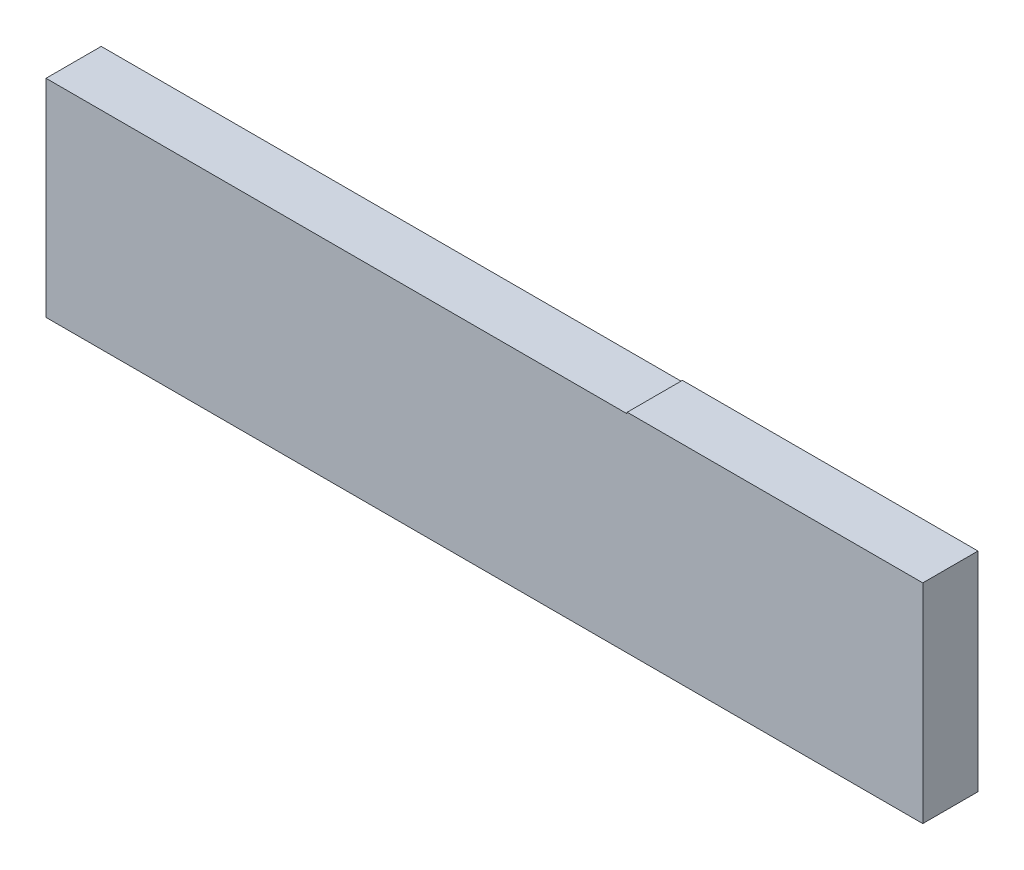
ISO-10303-21;
HEADER;
FILE_DESCRIPTION(('STEP AP214'),'2;1');
FILE_NAME('part.step','',(''),(''),'','','');
FILE_SCHEMA(('AUTOMOTIVE_DESIGN { 1 0 10303 214 1 1 1 1 }'));
ENDSEC;
DATA;
#1=APPLICATION_CONTEXT('core data for automotive mechanical design processes');
#2=APPLICATION_PROTOCOL_DEFINITION('international standard','automotive_design',2000,#1);
#3=PRODUCT_CONTEXT('',#1,'mechanical');
#4=PRODUCT('Part','Part','',(#3));
#5=PRODUCT_RELATED_PRODUCT_CATEGORY('part','',(#4));
#6=PRODUCT_DEFINITION_FORMATION('','',#4);
#7=PRODUCT_DEFINITION_CONTEXT('part definition',#1,'design');
#8=PRODUCT_DEFINITION('design','',#6,#7);
#9=PRODUCT_DEFINITION_SHAPE('','',#8);
#10=(LENGTH_UNIT() NAMED_UNIT(*) SI_UNIT(.MILLI.,.METRE.));
#11=(NAMED_UNIT(*) PLANE_ANGLE_UNIT() SI_UNIT($,.RADIAN.));
#12=(NAMED_UNIT(*) SI_UNIT($,.STERADIAN.) SOLID_ANGLE_UNIT());
#13=UNCERTAINTY_MEASURE_WITH_UNIT(LENGTH_MEASURE(1.E-05),#10,'distance_accuracy_value','');
#14=(GEOMETRIC_REPRESENTATION_CONTEXT(3) GLOBAL_UNCERTAINTY_ASSIGNED_CONTEXT((#13)) GLOBAL_UNIT_ASSIGNED_CONTEXT((#10,
#11,#12)) REPRESENTATION_CONTEXT('',''));
#15=CARTESIAN_POINT('',(0.,0.,0.));
#16=DIRECTION('',(0.,0.,1.));
#17=DIRECTION('',(1.,0.,0.));
#18=AXIS2_PLACEMENT_3D('',#15,#16,#17);
#19=CARTESIAN_POINT('',(0.,0.,4.));
#20=DIRECTION('',(1.,0.,0.));
#21=DIRECTION('',(0.,0.,-1.));
#22=AXIS2_PLACEMENT_3D('',#19,#20,#21);
#23=PLANE('',#22);
#24=DIRECTION('',(0.,-1.,0.));
#25=VECTOR('',#24,1.);
#26=CARTESIAN_POINT('',(0.,0.,0.));
#27=LINE('',#26,#25);
#28=CARTESIAN_POINT('',(0.,15.,0.));
#29=VERTEX_POINT('',#28);
#30=CARTESIAN_POINT('',(0.,0.,0.));
#31=VERTEX_POINT('',#30);
#32=EDGE_CURVE('E117',#29,#31,#27,.T.);
#33=ORIENTED_EDGE('',*,*,#32,.T.);
#34=DIRECTION('',(0.,0.,-1.));
#35=VECTOR('',#34,1.);
#36=CARTESIAN_POINT('',(0.,0.,4.));
#37=LINE('',#36,#35);
#38=CARTESIAN_POINT('',(0.,0.,4.));
#39=VERTEX_POINT('',#38);
#40=EDGE_CURVE('E11',#39,#31,#37,.T.);
#41=ORIENTED_EDGE('',*,*,#40,.F.);
#42=DIRECTION('',(0.,-1.,0.));
#43=VECTOR('',#42,1.);
#44=CARTESIAN_POINT('',(0.,0.,4.));
#45=LINE('',#44,#43);
#46=CARTESIAN_POINT('',(0.,15.,4.));
#47=VERTEX_POINT('',#46);
#48=EDGE_CURVE('E127',#47,#39,#45,.T.);
#49=ORIENTED_EDGE('',*,*,#48,.F.);
#50=DIRECTION('',(0.,0.,-1.));
#51=VECTOR('',#50,1.);
#52=CARTESIAN_POINT('',(0.,15.,4.));
#53=LINE('',#52,#51);
#54=EDGE_CURVE('E113',#47,#29,#53,.T.);
#55=ORIENTED_EDGE('',*,*,#54,.T.);
#56=EDGE_LOOP('',(#33,#41,#49,#55));
#57=FACE_BOUND('',#56,.T.);
#58=ADVANCED_FACE('F33',(#57),#23,.F.);
#59=CARTESIAN_POINT('',(63.502314546912,0.,4.));
#60=DIRECTION('',(0.,1.,0.));
#61=DIRECTION('',(0.,0.,1.));
#62=AXIS2_PLACEMENT_3D('',#59,#60,#61);
#63=PLANE('',#62);
#64=DIRECTION('',(1.,0.,0.));
#65=VECTOR('',#64,1.);
#66=CARTESIAN_POINT('',(63.502314546912,0.,0.));
#67=LINE('',#66,#65);
#68=CARTESIAN_POINT('',(63.502314546912,0.,0.));
#69=VERTEX_POINT('',#68);
#70=EDGE_CURVE('E120',#31,#69,#67,.T.);
#71=ORIENTED_EDGE('',*,*,#70,.T.);
#72=DIRECTION('',(0.,0.,-1.));
#73=VECTOR('',#72,1.);
#74=CARTESIAN_POINT('',(63.502314546912,0.,4.));
#75=LINE('',#74,#73);
#76=CARTESIAN_POINT('',(63.502314546912,0.,4.));
#77=VERTEX_POINT('',#76);
#78=EDGE_CURVE('E41',#77,#69,#75,.T.);
#79=ORIENTED_EDGE('',*,*,#78,.F.);
#80=DIRECTION('',(1.,0.,0.));
#81=VECTOR('',#80,1.);
#82=CARTESIAN_POINT('',(0.,0.,4.));
#83=LINE('',#82,#81);
#84=EDGE_CURVE('E86',#39,#77,#83,.T.);
#85=ORIENTED_EDGE('',*,*,#84,.F.);
#86=ORIENTED_EDGE('',*,*,#40,.T.);
#87=EDGE_LOOP('',(#71,#79,#85,#86));
#88=FACE_BOUND('',#87,.T.);
#89=ADVANCED_FACE('F151',(#88),#63,.F.);
#90=CARTESIAN_POINT('',(63.502314546912,15.1,4.));
#91=DIRECTION('',(-1.,0.,0.));
#92=DIRECTION('',(0.,0.,1.));
#93=AXIS2_PLACEMENT_3D('',#90,#91,#92);
#94=PLANE('',#93);
#95=DIRECTION('',(0.,1.,0.));
#96=VECTOR('',#95,1.);
#97=CARTESIAN_POINT('',(63.502314546912,15.1,0.));
#98=LINE('',#97,#96);
#99=CARTESIAN_POINT('',(63.502314546912,15.1,0.));
#100=VERTEX_POINT('',#99);
#101=EDGE_CURVE('E122',#69,#100,#98,.T.);
#102=ORIENTED_EDGE('',*,*,#101,.T.);
#103=DIRECTION('',(0.,0.,-1.));
#104=VECTOR('',#103,1.);
#105=CARTESIAN_POINT('',(63.502314546912,15.1,4.));
#106=LINE('',#105,#104);
#107=CARTESIAN_POINT('',(63.502314546912,15.1,4.));
#108=VERTEX_POINT('',#107);
#109=EDGE_CURVE('E108',#108,#100,#106,.T.);
#110=ORIENTED_EDGE('',*,*,#109,.F.);
#111=DIRECTION('',(0.,1.,0.));
#112=VECTOR('',#111,1.);
#113=CARTESIAN_POINT('',(63.502314546912,15.1,4.));
#114=LINE('',#113,#112);
#115=EDGE_CURVE('E99',#77,#108,#114,.T.);
#116=ORIENTED_EDGE('',*,*,#115,.F.);
#117=ORIENTED_EDGE('',*,*,#78,.T.);
#118=EDGE_LOOP('',(#102,#110,#116,#117));
#119=FACE_BOUND('',#118,.T.);
#120=ADVANCED_FACE('F133',(#119),#94,.F.);
#121=CARTESIAN_POINT('',(42.0949347246998,15.1,4.));
#122=DIRECTION('',(0.,-1.,0.));
#123=DIRECTION('',(1.,0.,0.));
#124=AXIS2_PLACEMENT_3D('',#121,#122,#123);
#125=PLANE('',#124);
#126=DIRECTION('',(-1.,0.,0.));
#127=VECTOR('',#126,1.);
#128=CARTESIAN_POINT('',(42.0949347246998,15.1,0.));
#129=LINE('',#128,#127);
#130=CARTESIAN_POINT('',(42.0949347246998,15.1,0.));
#131=VERTEX_POINT('',#130);
#132=EDGE_CURVE('E107',#100,#131,#129,.T.);
#133=ORIENTED_EDGE('',*,*,#132,.T.);
#134=DIRECTION('',(0.,0.,-1.));
#135=VECTOR('',#134,1.);
#136=CARTESIAN_POINT('',(42.0949347246998,15.1,4.));
#137=LINE('',#136,#135);
#138=CARTESIAN_POINT('',(42.0949347246998,15.1,4.));
#139=VERTEX_POINT('',#138);
#140=EDGE_CURVE('E104',#139,#131,#137,.T.);
#141=ORIENTED_EDGE('',*,*,#140,.F.);
#142=DIRECTION('',(-1.,0.,0.));
#143=VECTOR('',#142,1.);
#144=CARTESIAN_POINT('',(42.0949347246998,15.1,4.));
#145=LINE('',#144,#143);
#146=EDGE_CURVE('E93',#108,#139,#145,.T.);
#147=ORIENTED_EDGE('',*,*,#146,.F.);
#148=ORIENTED_EDGE('',*,*,#109,.T.);
#149=EDGE_LOOP('',(#133,#141,#147,#148));
#150=FACE_BOUND('',#149,.T.);
#151=ADVANCED_FACE('F105',(#150),#125,.F.);
#152=CARTESIAN_POINT('',(42.0949347246998,15.,4.));
#153=DIRECTION('',(1.,0.,0.));
#154=DIRECTION('',(0.,0.,-1.));
#155=AXIS2_PLACEMENT_3D('',#152,#153,#154);
#156=PLANE('',#155);
#157=DIRECTION('',(0.,-1.,0.));
#158=VECTOR('',#157,1.);
#159=CARTESIAN_POINT('',(42.0949347246998,15.,0.));
#160=LINE('',#159,#158);
#161=CARTESIAN_POINT('',(42.0949347246998,15.,0.));
#162=VERTEX_POINT('',#161);
#163=EDGE_CURVE('E72',#131,#162,#160,.T.);
#164=ORIENTED_EDGE('',*,*,#163,.T.);
#165=DIRECTION('',(0.,0.,-1.));
#166=VECTOR('',#165,1.);
#167=CARTESIAN_POINT('',(42.0949347246998,15.,4.));
#168=LINE('',#167,#166);
#169=CARTESIAN_POINT('',(42.0949347246998,15.,4.));
#170=VERTEX_POINT('',#169);
#171=EDGE_CURVE('E109',#170,#162,#168,.T.);
#172=ORIENTED_EDGE('',*,*,#171,.F.);
#173=DIRECTION('',(0.,-1.,0.));
#174=VECTOR('',#173,1.);
#175=CARTESIAN_POINT('',(42.0949347246998,15.,4.));
#176=LINE('',#175,#174);
#177=EDGE_CURVE('E97',#139,#170,#176,.T.);
#178=ORIENTED_EDGE('',*,*,#177,.F.);
#179=ORIENTED_EDGE('',*,*,#140,.T.);
#180=EDGE_LOOP('',(#164,#172,#178,#179));
#181=FACE_BOUND('',#180,.T.);
#182=ADVANCED_FACE('F111',(#181),#156,.F.);
#183=CARTESIAN_POINT('',(0.,15.,4.));
#184=DIRECTION('',(0.,-1.,0.));
#185=DIRECTION('',(0.,0.,-1.));
#186=AXIS2_PLACEMENT_3D('',#183,#184,#185);
#187=PLANE('',#186);
#188=DIRECTION('',(-1.,0.,0.));
#189=VECTOR('',#188,1.);
#190=CARTESIAN_POINT('',(0.,15.,0.));
#191=LINE('',#190,#189);
#192=EDGE_CURVE('E78',#162,#29,#191,.T.);
#193=ORIENTED_EDGE('',*,*,#192,.T.);
#194=ORIENTED_EDGE('',*,*,#54,.F.);
#195=DIRECTION('',(-1.,0.,0.));
#196=VECTOR('',#195,1.);
#197=CARTESIAN_POINT('',(0.,15.,4.));
#198=LINE('',#197,#196);
#199=EDGE_CURVE('E49',#170,#47,#198,.T.);
#200=ORIENTED_EDGE('',*,*,#199,.F.);
#201=ORIENTED_EDGE('',*,*,#171,.T.);
#202=EDGE_LOOP('',(#193,#194,#200,#201));
#203=FACE_BOUND('',#202,.T.);
#204=ADVANCED_FACE('F140',(#203),#187,.F.);
#205=CARTESIAN_POINT('',(0.,0.,4.));
#206=DIRECTION('',(0.,0.,-1.));
#207=DIRECTION('',(-1.,0.,0.));
#208=AXIS2_PLACEMENT_3D('',#205,#206,#207);
#209=PLANE('',#208);
#210=ORIENTED_EDGE('',*,*,#48,.T.);
#211=ORIENTED_EDGE('',*,*,#84,.T.);
#212=ORIENTED_EDGE('',*,*,#115,.T.);
#213=ORIENTED_EDGE('',*,*,#146,.T.);
#214=ORIENTED_EDGE('',*,*,#177,.T.);
#215=ORIENTED_EDGE('',*,*,#199,.T.);
#216=EDGE_LOOP('',(#210,#211,#212,#213,#214,#215));
#217=FACE_BOUND('',#216,.T.);
#218=ADVANCED_FACE('F95',(#217),#209,.F.);
#219=CARTESIAN_POINT('',(0.,0.,0.));
#220=DIRECTION('',(0.,0.,-1.));
#221=DIRECTION('',(-1.,0.,0.));
#222=AXIS2_PLACEMENT_3D('',#219,#220,#221);
#223=PLANE('',#222);
#224=ORIENTED_EDGE('',*,*,#32,.F.);
#225=ORIENTED_EDGE('',*,*,#192,.F.);
#226=ORIENTED_EDGE('',*,*,#163,.F.);
#227=ORIENTED_EDGE('',*,*,#132,.F.);
#228=ORIENTED_EDGE('',*,*,#101,.F.);
#229=ORIENTED_EDGE('',*,*,#70,.F.);
#230=EDGE_LOOP('',(#224,#225,#226,#227,#228,#229));
#231=FACE_BOUND('',#230,.T.);
#232=ADVANCED_FACE('F136',(#231),#223,.T.);
#233=CLOSED_SHELL('',(#58,#89,#120,#151,#182,#204,#218,#232));
#234=MANIFOLD_SOLID_BREP('B2',#233);
#235=ADVANCED_BREP_SHAPE_REPRESENTATION('',(#18,#234),#14);
#236=SHAPE_DEFINITION_REPRESENTATION(#9,#235);
ENDSEC;
END-ISO-10303-21;
